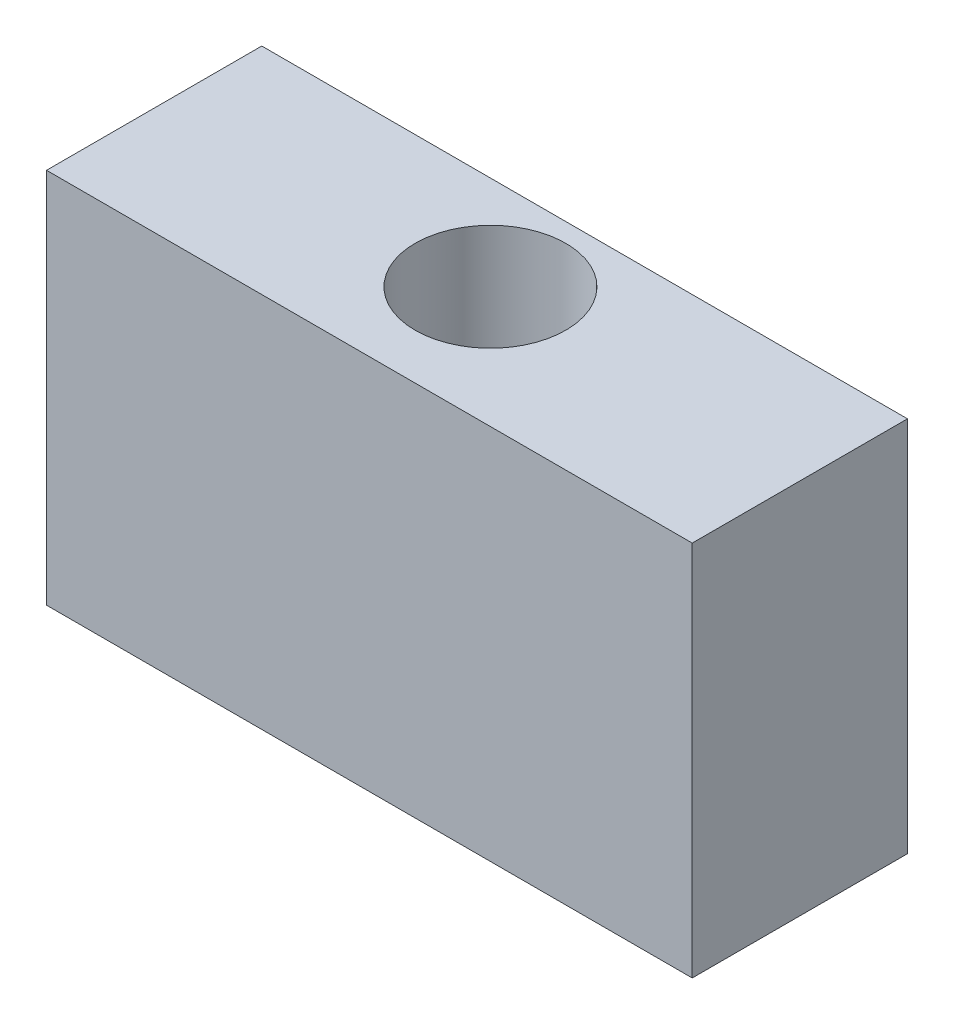
ISO-10303-21;
HEADER;
FILE_DESCRIPTION(('STEP AP214'),'2;1');
FILE_NAME('part.step','',(''),(''),'','','');
FILE_SCHEMA(('AUTOMOTIVE_DESIGN { 1 0 10303 214 1 1 1 1 }'));
ENDSEC;
DATA;
#1=APPLICATION_CONTEXT('core data for automotive mechanical design processes');
#2=APPLICATION_PROTOCOL_DEFINITION('international standard','automotive_design',2000,#1);
#3=PRODUCT_CONTEXT('',#1,'mechanical');
#4=PRODUCT('Part','Part','',(#3));
#5=PRODUCT_RELATED_PRODUCT_CATEGORY('part','',(#4));
#6=PRODUCT_DEFINITION_FORMATION('','',#4);
#7=PRODUCT_DEFINITION_CONTEXT('part definition',#1,'design');
#8=PRODUCT_DEFINITION('design','',#6,#7);
#9=PRODUCT_DEFINITION_SHAPE('','',#8);
#10=(LENGTH_UNIT() NAMED_UNIT(*) SI_UNIT(.MILLI.,.METRE.));
#11=(NAMED_UNIT(*) PLANE_ANGLE_UNIT() SI_UNIT($,.RADIAN.));
#12=(NAMED_UNIT(*) SI_UNIT($,.STERADIAN.) SOLID_ANGLE_UNIT());
#13=UNCERTAINTY_MEASURE_WITH_UNIT(LENGTH_MEASURE(1.E-05),#10,'distance_accuracy_value','');
#14=(GEOMETRIC_REPRESENTATION_CONTEXT(3) GLOBAL_UNCERTAINTY_ASSIGNED_CONTEXT((#13)) GLOBAL_UNIT_ASSIGNED_CONTEXT((#10,
#11,#12)) REPRESENTATION_CONTEXT('',''));
#15=CARTESIAN_POINT('',(0.,0.,0.));
#16=DIRECTION('',(0.,0.,1.));
#17=DIRECTION('',(1.,0.,0.));
#18=AXIS2_PLACEMENT_3D('',#15,#16,#17);
#19=CARTESIAN_POINT('',(0.,22.225,0.));
#20=DIRECTION('',(0.,-1.,0.));
#21=DIRECTION('',(0.,0.,-1.));
#22=AXIS2_PLACEMENT_3D('',#19,#20,#21);
#23=PLANE('',#22);
#24=DIRECTION('',(0.,0.,1.));
#25=VECTOR('',#24,1.);
#26=CARTESIAN_POINT('',(0.,22.225,0.));
#27=LINE('',#26,#25);
#28=CARTESIAN_POINT('',(0.,22.225,-12.7));
#29=VERTEX_POINT('',#28);
#30=CARTESIAN_POINT('',(0.,22.225,0.));
#31=VERTEX_POINT('',#30);
#32=EDGE_CURVE('E85',#29,#31,#27,.T.);
#33=ORIENTED_EDGE('',*,*,#32,.T.);
#34=DIRECTION('',(1.,0.,0.));
#35=VECTOR('',#34,1.);
#36=CARTESIAN_POINT('',(0.,22.225,0.));
#37=LINE('',#36,#35);
#38=CARTESIAN_POINT('',(38.1,22.225,0.));
#39=VERTEX_POINT('',#38);
#40=EDGE_CURVE('E80',#31,#39,#37,.T.);
#41=ORIENTED_EDGE('',*,*,#40,.T.);
#42=DIRECTION('',(0.,0.,-1.));
#43=VECTOR('',#42,1.);
#44=CARTESIAN_POINT('',(38.1,22.225,0.));
#45=LINE('',#44,#43);
#46=CARTESIAN_POINT('',(38.1,22.225,-12.7));
#47=VERTEX_POINT('',#46);
#48=EDGE_CURVE('E83',#39,#47,#45,.T.);
#49=ORIENTED_EDGE('',*,*,#48,.T.);
#50=DIRECTION('',(-1.,0.,0.));
#51=VECTOR('',#50,1.);
#52=CARTESIAN_POINT('',(0.,22.225,-12.7));
#53=LINE('',#52,#51);
#54=EDGE_CURVE('E50',#47,#29,#53,.T.);
#55=ORIENTED_EDGE('',*,*,#54,.T.);
#56=EDGE_LOOP('',(#33,#41,#49,#55));
#57=FACE_BOUND('',#56,.T.);
#58=CARTESIAN_POINT('',(19.05,22.225,-7.14375));
#59=DIRECTION('',(0.,1.,0.));
#60=DIRECTION('',(0.,0.,1.));
#61=AXIS2_PLACEMENT_3D('',#58,#59,#60);
#62=CIRCLE('',#61,4.445);
#63=CARTESIAN_POINT('',(19.05,22.225,-2.69875));
#64=VERTEX_POINT('',#63);
#65=EDGE_CURVE('E100',#64,#64,#62,.T.);
#66=ORIENTED_EDGE('',*,*,#65,.F.);
#67=EDGE_LOOP('',(#66));
#68=FACE_BOUND('',#67,.T.);
#69=ADVANCED_FACE('F33',(#57,#68),#23,.F.);
#70=CARTESIAN_POINT('',(0.,0.,0.));
#71=DIRECTION('',(0.,-1.,0.));
#72=DIRECTION('',(0.,0.,-1.));
#73=AXIS2_PLACEMENT_3D('',#70,#71,#72);
#74=PLANE('',#73);
#75=DIRECTION('',(0.,0.,1.));
#76=VECTOR('',#75,1.);
#77=CARTESIAN_POINT('',(0.,0.,0.));
#78=LINE('',#77,#76);
#79=CARTESIAN_POINT('',(0.,0.,-12.7));
#80=VERTEX_POINT('',#79);
#81=CARTESIAN_POINT('',(0.,0.,0.));
#82=VERTEX_POINT('',#81);
#83=EDGE_CURVE('E97',#80,#82,#78,.T.);
#84=ORIENTED_EDGE('',*,*,#83,.F.);
#85=DIRECTION('',(-1.,0.,0.));
#86=VECTOR('',#85,1.);
#87=CARTESIAN_POINT('',(0.,0.,-12.7));
#88=LINE('',#87,#86);
#89=CARTESIAN_POINT('',(38.1,0.,-12.7));
#90=VERTEX_POINT('',#89);
#91=EDGE_CURVE('E73',#90,#80,#88,.T.);
#92=ORIENTED_EDGE('',*,*,#91,.F.);
#93=DIRECTION('',(0.,0.,-1.));
#94=VECTOR('',#93,1.);
#95=CARTESIAN_POINT('',(38.1,0.,0.));
#96=LINE('',#95,#94);
#97=CARTESIAN_POINT('',(38.1,0.,0.));
#98=VERTEX_POINT('',#97);
#99=EDGE_CURVE('E67',#98,#90,#96,.T.);
#100=ORIENTED_EDGE('',*,*,#99,.F.);
#101=DIRECTION('',(1.,0.,0.));
#102=VECTOR('',#101,1.);
#103=CARTESIAN_POINT('',(0.,0.,0.));
#104=LINE('',#103,#102);
#105=EDGE_CURVE('E89',#82,#98,#104,.T.);
#106=ORIENTED_EDGE('',*,*,#105,.F.);
#107=EDGE_LOOP('',(#84,#92,#100,#106));
#108=FACE_BOUND('',#107,.T.);
#109=CARTESIAN_POINT('',(19.05,0.,-7.14375));
#110=DIRECTION('',(0.,1.,0.));
#111=DIRECTION('',(0.,0.,1.));
#112=AXIS2_PLACEMENT_3D('',#109,#110,#111);
#113=CIRCLE('',#112,4.445);
#114=CARTESIAN_POINT('',(19.05,0.,-2.69875));
#115=VERTEX_POINT('',#114);
#116=EDGE_CURVE('E112',#115,#115,#113,.T.);
#117=ORIENTED_EDGE('',*,*,#116,.T.);
#118=EDGE_LOOP('',(#117));
#119=FACE_BOUND('',#118,.T.);
#120=ADVANCED_FACE('F108',(#108,#119),#74,.T.);
#121=CARTESIAN_POINT('',(0.,22.225,0.));
#122=DIRECTION('',(1.,0.,0.));
#123=DIRECTION('',(0.,0.,-1.));
#124=AXIS2_PLACEMENT_3D('',#121,#122,#123);
#125=PLANE('',#124);
#126=ORIENTED_EDGE('',*,*,#83,.T.);
#127=DIRECTION('',(0.,-1.,0.));
#128=VECTOR('',#127,1.);
#129=CARTESIAN_POINT('',(0.,22.225,0.));
#130=LINE('',#129,#128);
#131=EDGE_CURVE('E11',#31,#82,#130,.T.);
#132=ORIENTED_EDGE('',*,*,#131,.F.);
#133=ORIENTED_EDGE('',*,*,#32,.F.);
#134=DIRECTION('',(0.,-1.,0.));
#135=VECTOR('',#134,1.);
#136=CARTESIAN_POINT('',(0.,22.225,-12.7));
#137=LINE('',#136,#135);
#138=EDGE_CURVE('E93',#29,#80,#137,.T.);
#139=ORIENTED_EDGE('',*,*,#138,.T.);
#140=EDGE_LOOP('',(#126,#132,#133,#139));
#141=FACE_BOUND('',#140,.T.);
#142=ADVANCED_FACE('F35',(#141),#125,.F.);
#143=CARTESIAN_POINT('',(0.,22.225,0.));
#144=DIRECTION('',(0.,0.,-1.));
#145=DIRECTION('',(-1.,0.,0.));
#146=AXIS2_PLACEMENT_3D('',#143,#144,#145);
#147=PLANE('',#146);
#148=ORIENTED_EDGE('',*,*,#105,.T.);
#149=DIRECTION('',(0.,-1.,0.));
#150=VECTOR('',#149,1.);
#151=CARTESIAN_POINT('',(38.1,22.225,0.));
#152=LINE('',#151,#150);
#153=EDGE_CURVE('E42',#39,#98,#152,.T.);
#154=ORIENTED_EDGE('',*,*,#153,.F.);
#155=ORIENTED_EDGE('',*,*,#40,.F.);
#156=ORIENTED_EDGE('',*,*,#131,.T.);
#157=EDGE_LOOP('',(#148,#154,#155,#156));
#158=FACE_BOUND('',#157,.T.);
#159=ADVANCED_FACE('F88',(#158),#147,.F.);
#160=CARTESIAN_POINT('',(38.1,22.225,0.));
#161=DIRECTION('',(-1.,0.,0.));
#162=DIRECTION('',(0.,0.,1.));
#163=AXIS2_PLACEMENT_3D('',#160,#161,#162);
#164=PLANE('',#163);
#165=ORIENTED_EDGE('',*,*,#99,.T.);
#166=DIRECTION('',(0.,-1.,0.));
#167=VECTOR('',#166,1.);
#168=CARTESIAN_POINT('',(38.1,22.225,-12.7));
#169=LINE('',#168,#167);
#170=EDGE_CURVE('E90',#47,#90,#169,.T.);
#171=ORIENTED_EDGE('',*,*,#170,.F.);
#172=ORIENTED_EDGE('',*,*,#48,.F.);
#173=ORIENTED_EDGE('',*,*,#153,.T.);
#174=EDGE_LOOP('',(#165,#171,#172,#173));
#175=FACE_BOUND('',#174,.T.);
#176=ADVANCED_FACE('F91',(#175),#164,.F.);
#177=CARTESIAN_POINT('',(0.,22.225,-12.7));
#178=DIRECTION('',(0.,0.,1.));
#179=DIRECTION('',(1.,0.,0.));
#180=AXIS2_PLACEMENT_3D('',#177,#178,#179);
#181=PLANE('',#180);
#182=ORIENTED_EDGE('',*,*,#91,.T.);
#183=ORIENTED_EDGE('',*,*,#138,.F.);
#184=ORIENTED_EDGE('',*,*,#54,.F.);
#185=ORIENTED_EDGE('',*,*,#170,.T.);
#186=EDGE_LOOP('',(#182,#183,#184,#185));
#187=FACE_BOUND('',#186,.T.);
#188=ADVANCED_FACE('F105',(#187),#181,.F.);
#189=CARTESIAN_POINT('',(19.05,22.225,-7.14375));
#190=DIRECTION('',(0.,-1.,0.));
#191=DIRECTION('',(0.,0.,-1.));
#192=AXIS2_PLACEMENT_3D('',#189,#190,#191);
#193=CYLINDRICAL_SURFACE('',#192,4.445);
#194=ORIENTED_EDGE('',*,*,#65,.T.);
#195=EDGE_LOOP('',(#194));
#196=FACE_BOUND('',#195,.T.);
#197=ORIENTED_EDGE('',*,*,#116,.F.);
#198=EDGE_LOOP('',(#197));
#199=FACE_BOUND('',#198,.T.);
#200=ADVANCED_FACE('F118',(#196,#199),#193,.F.);
#201=CLOSED_SHELL('',(#69,#120,#142,#159,#176,#188,#200));
#202=MANIFOLD_SOLID_BREP('B2',#201);
#203=ADVANCED_BREP_SHAPE_REPRESENTATION('',(#18,#202),#14);
#204=SHAPE_DEFINITION_REPRESENTATION(#9,#203);
ENDSEC;
END-ISO-10303-21;
